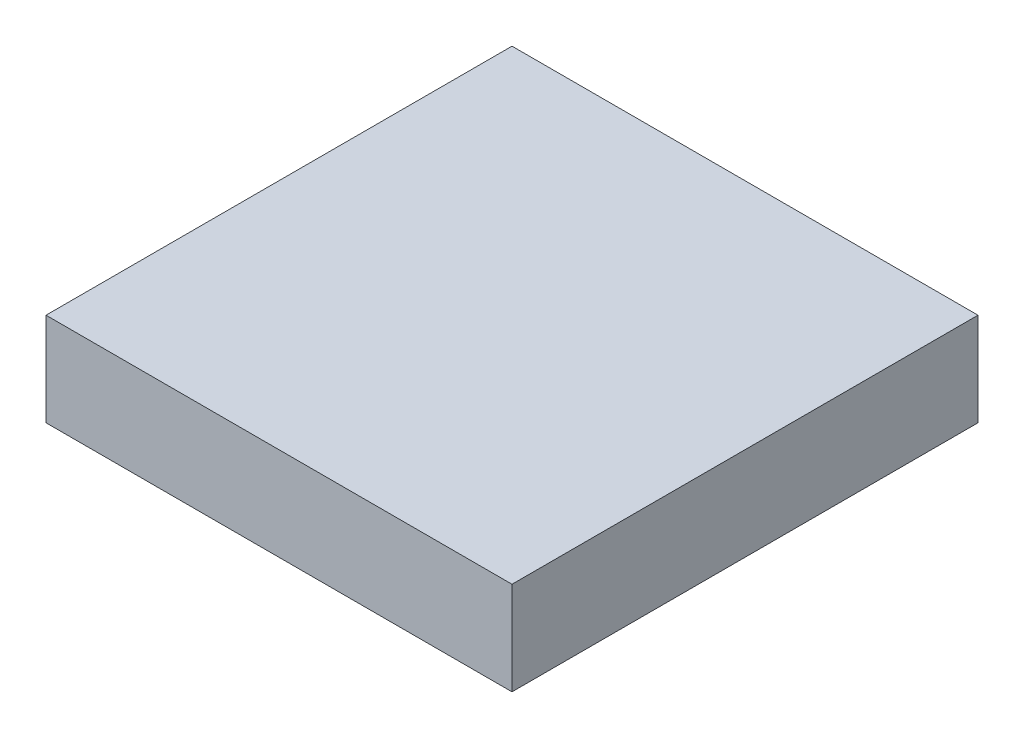
ISO-10303-21;
HEADER;
FILE_DESCRIPTION(('STEP AP214'),'2;1');
FILE_NAME('part.step','',(''),(''),'','','');
FILE_SCHEMA(('AUTOMOTIVE_DESIGN { 1 0 10303 214 1 1 1 1 }'));
ENDSEC;
DATA;
#1=APPLICATION_CONTEXT('core data for automotive mechanical design processes');
#2=APPLICATION_PROTOCOL_DEFINITION('international standard','automotive_design',2000,#1);
#3=PRODUCT_CONTEXT('',#1,'mechanical');
#4=PRODUCT('Part','Part','',(#3));
#5=PRODUCT_RELATED_PRODUCT_CATEGORY('part','',(#4));
#6=PRODUCT_DEFINITION_FORMATION('','',#4);
#7=PRODUCT_DEFINITION_CONTEXT('part definition',#1,'design');
#8=PRODUCT_DEFINITION('design','',#6,#7);
#9=PRODUCT_DEFINITION_SHAPE('','',#8);
#10=(LENGTH_UNIT() NAMED_UNIT(*) SI_UNIT(.MILLI.,.METRE.));
#11=(NAMED_UNIT(*) PLANE_ANGLE_UNIT() SI_UNIT($,.RADIAN.));
#12=(NAMED_UNIT(*) SI_UNIT($,.STERADIAN.) SOLID_ANGLE_UNIT());
#13=UNCERTAINTY_MEASURE_WITH_UNIT(LENGTH_MEASURE(1.E-05),#10,'distance_accuracy_value','');
#14=(GEOMETRIC_REPRESENTATION_CONTEXT(3) GLOBAL_UNCERTAINTY_ASSIGNED_CONTEXT((#13)) GLOBAL_UNIT_ASSIGNED_CONTEXT((#10,
#11,#12)) REPRESENTATION_CONTEXT('',''));
#15=CARTESIAN_POINT('',(0.,0.,0.));
#16=DIRECTION('',(0.,0.,1.));
#17=DIRECTION('',(1.,0.,0.));
#18=AXIS2_PLACEMENT_3D('',#15,#16,#17);
#19=CARTESIAN_POINT('',(7.5,3.,7.5));
#20=DIRECTION('',(-1.,0.,0.));
#21=DIRECTION('',(0.,0.,1.));
#22=AXIS2_PLACEMENT_3D('',#19,#20,#21);
#23=PLANE('',#22);
#24=DIRECTION('',(0.,0.,-1.));
#25=VECTOR('',#24,1.);
#26=CARTESIAN_POINT('',(7.5,0.,7.5));
#27=LINE('',#26,#25);
#28=CARTESIAN_POINT('',(7.5,0.,7.5));
#29=VERTEX_POINT('',#28);
#30=CARTESIAN_POINT('',(7.5,0.,-7.5));
#31=VERTEX_POINT('',#30);
#32=EDGE_CURVE('E145',#29,#31,#27,.T.);
#33=ORIENTED_EDGE('',*,*,#32,.T.);
#34=DIRECTION('',(0.,-1.,0.));
#35=VECTOR('',#34,1.);
#36=CARTESIAN_POINT('',(7.5,3.,-7.5));
#37=LINE('',#36,#35);
#38=CARTESIAN_POINT('',(7.5,3.,-7.5));
#39=VERTEX_POINT('',#38);
#40=EDGE_CURVE('E11',#39,#31,#37,.T.);
#41=ORIENTED_EDGE('',*,*,#40,.F.);
#42=DIRECTION('',(0.,0.,-1.));
#43=VECTOR('',#42,1.);
#44=CARTESIAN_POINT('',(7.5,3.,7.5));
#45=LINE('',#44,#43);
#46=CARTESIAN_POINT('',(7.5,3.,7.5));
#47=VERTEX_POINT('',#46);
#48=EDGE_CURVE('E149',#47,#39,#45,.T.);
#49=ORIENTED_EDGE('',*,*,#48,.F.);
#50=DIRECTION('',(0.,-1.,0.));
#51=VECTOR('',#50,1.);
#52=CARTESIAN_POINT('',(7.5,3.,7.5));
#53=LINE('',#52,#51);
#54=EDGE_CURVE('E155',#47,#29,#53,.T.);
#55=ORIENTED_EDGE('',*,*,#54,.T.);
#56=EDGE_LOOP('',(#33,#41,#49,#55));
#57=FACE_BOUND('',#56,.T.);
#58=ADVANCED_FACE('F33',(#57),#23,.F.);
#59=CARTESIAN_POINT('',(-7.5,3.,-7.5));
#60=DIRECTION('',(0.,0.,1.));
#61=DIRECTION('',(1.,0.,0.));
#62=AXIS2_PLACEMENT_3D('',#59,#60,#61);
#63=PLANE('',#62);
#64=DIRECTION('',(-1.,0.,0.));
#65=VECTOR('',#64,1.);
#66=CARTESIAN_POINT('',(-7.5,0.,-7.5));
#67=LINE('',#66,#65);
#68=CARTESIAN_POINT('',(-7.5,0.,-7.5));
#69=VERTEX_POINT('',#68);
#70=EDGE_CURVE('E158',#31,#69,#67,.T.);
#71=ORIENTED_EDGE('',*,*,#70,.T.);
#72=DIRECTION('',(0.,-1.,0.));
#73=VECTOR('',#72,1.);
#74=CARTESIAN_POINT('',(-7.5,3.,-7.5));
#75=LINE('',#74,#73);
#76=CARTESIAN_POINT('',(-7.5,3.,-7.5));
#77=VERTEX_POINT('',#76);
#78=EDGE_CURVE('E40',#77,#69,#75,.T.);
#79=ORIENTED_EDGE('',*,*,#78,.F.);
#80=DIRECTION('',(-1.,0.,0.));
#81=VECTOR('',#80,1.);
#82=CARTESIAN_POINT('',(-7.5,3.,-7.5));
#83=LINE('',#82,#81);
#84=EDGE_CURVE('E84',#39,#77,#83,.T.);
#85=ORIENTED_EDGE('',*,*,#84,.F.);
#86=ORIENTED_EDGE('',*,*,#40,.T.);
#87=EDGE_LOOP('',(#71,#79,#85,#86));
#88=FACE_BOUND('',#87,.T.);
#89=ADVANCED_FACE('F186',(#88),#63,.F.);
#90=CARTESIAN_POINT('',(-7.5,3.,7.5));
#91=DIRECTION('',(1.,0.,0.));
#92=DIRECTION('',(0.,0.,-1.));
#93=AXIS2_PLACEMENT_3D('',#90,#91,#92);
#94=PLANE('',#93);
#95=DIRECTION('',(0.,0.,1.));
#96=VECTOR('',#95,1.);
#97=CARTESIAN_POINT('',(-7.5,0.,7.5));
#98=LINE('',#97,#96);
#99=CARTESIAN_POINT('',(-7.5,0.,7.5));
#100=VERTEX_POINT('',#99);
#101=EDGE_CURVE('E160',#69,#100,#98,.T.);
#102=ORIENTED_EDGE('',*,*,#101,.T.);
#103=DIRECTION('',(0.,-1.,0.));
#104=VECTOR('',#103,1.);
#105=CARTESIAN_POINT('',(-7.5,3.,7.5));
#106=LINE('',#105,#104);
#107=CARTESIAN_POINT('',(-7.5,3.,7.5));
#108=VERTEX_POINT('',#107);
#109=EDGE_CURVE('E164',#108,#100,#106,.T.);
#110=ORIENTED_EDGE('',*,*,#109,.F.);
#111=DIRECTION('',(0.,0.,1.));
#112=VECTOR('',#111,1.);
#113=CARTESIAN_POINT('',(-7.5,3.,7.5));
#114=LINE('',#113,#112);
#115=EDGE_CURVE('E152',#77,#108,#114,.T.);
#116=ORIENTED_EDGE('',*,*,#115,.F.);
#117=ORIENTED_EDGE('',*,*,#78,.T.);
#118=EDGE_LOOP('',(#102,#110,#116,#117));
#119=FACE_BOUND('',#118,.T.);
#120=ADVANCED_FACE('F169',(#119),#94,.F.);
#121=CARTESIAN_POINT('',(-7.5,3.,7.5));
#122=DIRECTION('',(0.,0.,-1.));
#123=DIRECTION('',(-1.,0.,0.));
#124=AXIS2_PLACEMENT_3D('',#121,#122,#123);
#125=PLANE('',#124);
#126=DIRECTION('',(1.,0.,0.));
#127=VECTOR('',#126,1.);
#128=CARTESIAN_POINT('',(-7.5,0.,7.5));
#129=LINE('',#128,#127);
#130=EDGE_CURVE('E77',#100,#29,#129,.T.);
#131=ORIENTED_EDGE('',*,*,#130,.T.);
#132=ORIENTED_EDGE('',*,*,#54,.F.);
#133=DIRECTION('',(1.,0.,0.));
#134=VECTOR('',#133,1.);
#135=CARTESIAN_POINT('',(-7.5,3.,7.5));
#136=LINE('',#135,#134);
#137=EDGE_CURVE('E56',#108,#47,#136,.T.);
#138=ORIENTED_EDGE('',*,*,#137,.F.);
#139=ORIENTED_EDGE('',*,*,#109,.T.);
#140=EDGE_LOOP('',(#131,#132,#138,#139));
#141=FACE_BOUND('',#140,.T.);
#142=ADVANCED_FACE('F177',(#141),#125,.F.);
#143=CARTESIAN_POINT('',(0.,3.,0.));
#144=DIRECTION('',(0.,-1.,0.));
#145=DIRECTION('',(0.,0.,-1.));
#146=AXIS2_PLACEMENT_3D('',#143,#144,#145);
#147=PLANE('',#146);
#148=ORIENTED_EDGE('',*,*,#48,.T.);
#149=ORIENTED_EDGE('',*,*,#84,.T.);
#150=ORIENTED_EDGE('',*,*,#115,.T.);
#151=ORIENTED_EDGE('',*,*,#137,.T.);
#152=EDGE_LOOP('',(#148,#149,#150,#151));
#153=FACE_BOUND('',#152,.T.);
#154=ADVANCED_FACE('F179',(#153),#147,.F.);
#155=CARTESIAN_POINT('',(0.,0.,0.));
#156=DIRECTION('',(0.,-1.,0.));
#157=DIRECTION('',(0.,0.,-1.));
#158=AXIS2_PLACEMENT_3D('',#155,#156,#157);
#159=PLANE('',#158);
#160=CARTESIAN_POINT('',(-6.7,0.,-6.7));
#161=DIRECTION('',(0.,-1.,0.));
#162=DIRECTION('',(0.,0.,-1.));
#163=AXIS2_PLACEMENT_3D('',#160,#161,#162);
#164=CIRCLE('',#163,0.750000000000001);
#165=CARTESIAN_POINT('',(-6.7,0.,-7.45));
#166=VERTEX_POINT('',#165);
#167=EDGE_CURVE('E369',#166,#166,#164,.T.);
#168=ORIENTED_EDGE('',*,*,#167,.F.);
#169=EDGE_LOOP('',(#168));
#170=FACE_BOUND('',#169,.T.);
#171=CARTESIAN_POINT('',(6.7,0.,-6.7));
#172=DIRECTION('',(0.,-1.,0.));
#173=DIRECTION('',(0.,0.,-1.));
#174=AXIS2_PLACEMENT_3D('',#171,#172,#173);
#175=CIRCLE('',#174,0.750000000000001);
#176=CARTESIAN_POINT('',(6.7,0.,-7.45));
#177=VERTEX_POINT('',#176);
#178=EDGE_CURVE('E368',#177,#177,#175,.T.);
#179=ORIENTED_EDGE('',*,*,#178,.F.);
#180=EDGE_LOOP('',(#179));
#181=FACE_BOUND('',#180,.T.);
#182=CARTESIAN_POINT('',(6.7,0.,6.7));
#183=DIRECTION('',(0.,-1.,0.));
#184=DIRECTION('',(0.,0.,-1.));
#185=AXIS2_PLACEMENT_3D('',#182,#183,#184);
#186=CIRCLE('',#185,0.749999999999999);
#187=CARTESIAN_POINT('',(6.7,0.,5.95));
#188=VERTEX_POINT('',#187);
#189=EDGE_CURVE('E392',#188,#188,#186,.T.);
#190=ORIENTED_EDGE('',*,*,#189,.F.);
#191=EDGE_LOOP('',(#190));
#192=FACE_BOUND('',#191,.T.);
#193=CARTESIAN_POINT('',(-6.7,0.,6.7));
#194=DIRECTION('',(0.,-1.,0.));
#195=DIRECTION('',(0.,0.,-1.));
#196=AXIS2_PLACEMENT_3D('',#193,#194,#195);
#197=CIRCLE('',#196,0.750000000000001);
#198=CARTESIAN_POINT('',(-6.7,0.,5.95));
#199=VERTEX_POINT('',#198);
#200=EDGE_CURVE('E381',#199,#199,#197,.T.);
#201=ORIENTED_EDGE('',*,*,#200,.F.);
#202=EDGE_LOOP('',(#201));
#203=FACE_BOUND('',#202,.T.);
#204=DIRECTION('',(0.,0.,1.));
#205=VECTOR('',#204,1.);
#206=CARTESIAN_POINT('',(6.,0.,-6.));
#207=LINE('',#206,#205);
#208=CARTESIAN_POINT('',(6.,0.,-6.));
#209=VERTEX_POINT('',#208);
#210=CARTESIAN_POINT('',(6.,0.,6.));
#211=VERTEX_POINT('',#210);
#212=EDGE_CURVE('E47',#209,#211,#207,.T.);
#213=ORIENTED_EDGE('',*,*,#212,.F.);
#214=DIRECTION('',(1.,0.,0.));
#215=VECTOR('',#214,1.);
#216=CARTESIAN_POINT('',(-6.,0.,-6.));
#217=LINE('',#216,#215);
#218=CARTESIAN_POINT('',(-6.,0.,-6.));
#219=VERTEX_POINT('',#218);
#220=EDGE_CURVE('E126',#219,#209,#217,.T.);
#221=ORIENTED_EDGE('',*,*,#220,.F.);
#222=DIRECTION('',(0.,0.,-1.));
#223=VECTOR('',#222,1.);
#224=CARTESIAN_POINT('',(-6.,0.,-6.));
#225=LINE('',#224,#223);
#226=CARTESIAN_POINT('',(-6.,0.,6.));
#227=VERTEX_POINT('',#226);
#228=EDGE_CURVE('E129',#227,#219,#225,.T.);
#229=ORIENTED_EDGE('',*,*,#228,.F.);
#230=DIRECTION('',(-1.,0.,0.));
#231=VECTOR('',#230,1.);
#232=CARTESIAN_POINT('',(-6.,0.,6.));
#233=LINE('',#232,#231);
#234=EDGE_CURVE('E138',#211,#227,#233,.T.);
#235=ORIENTED_EDGE('',*,*,#234,.F.);
#236=EDGE_LOOP('',(#213,#221,#229,#235));
#237=FACE_BOUND('',#236,.T.);
#238=ORIENTED_EDGE('',*,*,#32,.F.);
#239=ORIENTED_EDGE('',*,*,#130,.F.);
#240=ORIENTED_EDGE('',*,*,#101,.F.);
#241=ORIENTED_EDGE('',*,*,#70,.F.);
#242=EDGE_LOOP('',(#238,#239,#240,#241));
#243=FACE_BOUND('',#242,.T.);
#244=ADVANCED_FACE('F173',(#170,#181,#192,#203,#237,#243),#159,.T.);
#245=CARTESIAN_POINT('',(6.,1.5,-6.));
#246=DIRECTION('',(1.,0.,0.));
#247=DIRECTION('',(0.,0.,-1.));
#248=AXIS2_PLACEMENT_3D('',#245,#246,#247);
#249=PLANE('',#248);
#250=ORIENTED_EDGE('',*,*,#212,.T.);
#251=DIRECTION('',(0.,-1.,0.));
#252=VECTOR('',#251,1.);
#253=CARTESIAN_POINT('',(6.,1.5,6.));
#254=LINE('',#253,#252);
#255=CARTESIAN_POINT('',(6.,1.5,6.));
#256=VERTEX_POINT('',#255);
#257=EDGE_CURVE('E104',#256,#211,#254,.T.);
#258=ORIENTED_EDGE('',*,*,#257,.F.);
#259=DIRECTION('',(0.,0.,1.));
#260=VECTOR('',#259,1.);
#261=CARTESIAN_POINT('',(6.,1.5,-6.));
#262=LINE('',#261,#260);
#263=CARTESIAN_POINT('',(6.,1.5,-6.));
#264=VERTEX_POINT('',#263);
#265=EDGE_CURVE('E108',#264,#256,#262,.T.);
#266=ORIENTED_EDGE('',*,*,#265,.F.);
#267=DIRECTION('',(0.,-1.,0.));
#268=VECTOR('',#267,1.);
#269=CARTESIAN_POINT('',(6.,1.5,-6.));
#270=LINE('',#269,#268);
#271=EDGE_CURVE('E143',#264,#209,#270,.T.);
#272=ORIENTED_EDGE('',*,*,#271,.T.);
#273=EDGE_LOOP('',(#250,#258,#266,#272));
#274=FACE_BOUND('',#273,.T.);
#275=ADVANCED_FACE('F106',(#274),#249,.F.);
#276=CARTESIAN_POINT('',(-6.,1.5,-6.));
#277=DIRECTION('',(0.,0.,-1.));
#278=DIRECTION('',(-1.,0.,0.));
#279=AXIS2_PLACEMENT_3D('',#276,#277,#278);
#280=PLANE('',#279);
#281=ORIENTED_EDGE('',*,*,#220,.T.);
#282=ORIENTED_EDGE('',*,*,#271,.F.);
#283=DIRECTION('',(1.,0.,0.));
#284=VECTOR('',#283,1.);
#285=CARTESIAN_POINT('',(-6.,1.5,-6.));
#286=LINE('',#285,#284);
#287=CARTESIAN_POINT('',(-6.,1.5,-6.));
#288=VERTEX_POINT('',#287);
#289=EDGE_CURVE('E114',#288,#264,#286,.T.);
#290=ORIENTED_EDGE('',*,*,#289,.F.);
#291=DIRECTION('',(0.,-1.,0.));
#292=VECTOR('',#291,1.);
#293=CARTESIAN_POINT('',(-6.,1.5,-6.));
#294=LINE('',#293,#292);
#295=EDGE_CURVE('E146',#288,#219,#294,.T.);
#296=ORIENTED_EDGE('',*,*,#295,.T.);
#297=EDGE_LOOP('',(#281,#282,#290,#296));
#298=FACE_BOUND('',#297,.T.);
#299=ADVANCED_FACE('F220',(#298),#280,.F.);
#300=CARTESIAN_POINT('',(-6.,1.5,-6.));
#301=DIRECTION('',(-1.,0.,0.));
#302=DIRECTION('',(0.,0.,1.));
#303=AXIS2_PLACEMENT_3D('',#300,#301,#302);
#304=PLANE('',#303);
#305=ORIENTED_EDGE('',*,*,#228,.T.);
#306=ORIENTED_EDGE('',*,*,#295,.F.);
#307=DIRECTION('',(0.,0.,-1.));
#308=VECTOR('',#307,1.);
#309=CARTESIAN_POINT('',(-6.,1.5,-6.));
#310=LINE('',#309,#308);
#311=CARTESIAN_POINT('',(-6.,1.5,6.));
#312=VERTEX_POINT('',#311);
#313=EDGE_CURVE('E122',#312,#288,#310,.T.);
#314=ORIENTED_EDGE('',*,*,#313,.F.);
#315=DIRECTION('',(0.,-1.,0.));
#316=VECTOR('',#315,1.);
#317=CARTESIAN_POINT('',(-6.,1.5,6.));
#318=LINE('',#317,#316);
#319=EDGE_CURVE('E113',#312,#227,#318,.T.);
#320=ORIENTED_EDGE('',*,*,#319,.T.);
#321=EDGE_LOOP('',(#305,#306,#314,#320));
#322=FACE_BOUND('',#321,.T.);
#323=ADVANCED_FACE('F230',(#322),#304,.F.);
#324=CARTESIAN_POINT('',(-6.,1.5,6.));
#325=DIRECTION('',(0.,0.,1.));
#326=DIRECTION('',(1.,0.,0.));
#327=AXIS2_PLACEMENT_3D('',#324,#325,#326);
#328=PLANE('',#327);
#329=ORIENTED_EDGE('',*,*,#234,.T.);
#330=ORIENTED_EDGE('',*,*,#319,.F.);
#331=DIRECTION('',(-1.,0.,0.));
#332=VECTOR('',#331,1.);
#333=CARTESIAN_POINT('',(-6.,1.5,6.));
#334=LINE('',#333,#332);
#335=EDGE_CURVE('E117',#256,#312,#334,.T.);
#336=ORIENTED_EDGE('',*,*,#335,.F.);
#337=ORIENTED_EDGE('',*,*,#257,.T.);
#338=EDGE_LOOP('',(#329,#330,#336,#337));
#339=FACE_BOUND('',#338,.T.);
#340=ADVANCED_FACE('F118',(#339),#328,.F.);
#341=CARTESIAN_POINT('',(0.,1.5,0.));
#342=DIRECTION('',(0.,1.,0.));
#343=DIRECTION('',(0.,0.,1.));
#344=AXIS2_PLACEMENT_3D('',#341,#342,#343);
#345=PLANE('',#344);
#346=CARTESIAN_POINT('',(0.,1.5,0.));
#347=DIRECTION('',(0.,-1.,0.));
#348=DIRECTION('',(0.,0.,-1.));
#349=AXIS2_PLACEMENT_3D('',#346,#347,#348);
#350=CIRCLE('',#349,2.5);
#351=CARTESIAN_POINT('',(0.,1.5,-2.5));
#352=VERTEX_POINT('',#351);
#353=EDGE_CURVE('E139',#352,#352,#350,.T.);
#354=ORIENTED_EDGE('',*,*,#353,.F.);
#355=EDGE_LOOP('',(#354));
#356=FACE_BOUND('',#355,.T.);
#357=ORIENTED_EDGE('',*,*,#265,.T.);
#358=ORIENTED_EDGE('',*,*,#335,.T.);
#359=ORIENTED_EDGE('',*,*,#313,.T.);
#360=ORIENTED_EDGE('',*,*,#289,.T.);
#361=EDGE_LOOP('',(#357,#358,#359,#360));
#362=FACE_BOUND('',#361,.T.);
#363=ADVANCED_FACE('F124',(#356,#362),#345,.F.);
#364=CARTESIAN_POINT('',(0.,1.5,0.));
#365=DIRECTION('',(0.,-1.,0.));
#366=DIRECTION('',(0.,0.,-1.));
#367=AXIS2_PLACEMENT_3D('',#364,#365,#366);
#368=CYLINDRICAL_SURFACE('',#367,2.5);
#369=ORIENTED_EDGE('',*,*,#353,.T.);
#370=EDGE_LOOP('',(#369));
#371=FACE_BOUND('',#370,.T.);
#372=CARTESIAN_POINT('',(0.,0.,0.));
#373=DIRECTION('',(0.,-1.,0.));
#374=DIRECTION('',(0.,0.,-1.));
#375=AXIS2_PLACEMENT_3D('',#372,#373,#374);
#376=CIRCLE('',#375,2.5);
#377=CARTESIAN_POINT('',(0.,0.,-2.5));
#378=VERTEX_POINT('',#377);
#379=EDGE_CURVE('E132',#378,#378,#376,.T.);
#380=ORIENTED_EDGE('',*,*,#379,.F.);
#381=EDGE_LOOP('',(#380));
#382=FACE_BOUND('',#381,.T.);
#383=ADVANCED_FACE('F257',(#371,#382),#368,.T.);
#384=ORIENTED_EDGE('',*,*,#379,.T.);
#385=EDGE_LOOP('',(#384));
#386=FACE_BOUND('',#385,.T.);
#387=ADVANCED_FACE('F267',(#386),#159,.T.);
#388=CARTESIAN_POINT('',(-6.7,2.,6.7));
#389=DIRECTION('',(0.,-1.,0.));
#390=DIRECTION('',(0.,0.,-1.));
#391=AXIS2_PLACEMENT_3D('',#388,#389,#390);
#392=CYLINDRICAL_SURFACE('',#391,0.750000000000001);
#393=CARTESIAN_POINT('',(-6.7,2.,6.7));
#394=DIRECTION('',(0.,-1.,0.));
#395=DIRECTION('',(0.,0.,-1.));
#396=AXIS2_PLACEMENT_3D('',#393,#394,#395);
#397=CIRCLE('',#396,0.750000000000001);
#398=CARTESIAN_POINT('',(-6.7,2.,5.95));
#399=VERTEX_POINT('',#398);
#400=EDGE_CURVE('E378',#399,#399,#397,.T.);
#401=ORIENTED_EDGE('',*,*,#400,.F.);
#402=EDGE_LOOP('',(#401));
#403=FACE_BOUND('',#402,.T.);
#404=ORIENTED_EDGE('',*,*,#200,.T.);
#405=EDGE_LOOP('',(#404));
#406=FACE_BOUND('',#405,.T.);
#407=ADVANCED_FACE('F277',(#403,#406),#392,.F.);
#408=CARTESIAN_POINT('',(-6.7,2.,6.7));
#409=DIRECTION('',(0.,-1.,0.));
#410=DIRECTION('',(0.,0.,-1.));
#411=AXIS2_PLACEMENT_3D('',#408,#409,#410);
#412=PLANE('',#411);
#413=ORIENTED_EDGE('',*,*,#400,.T.);
#414=EDGE_LOOP('',(#413));
#415=FACE_BOUND('',#414,.T.);
#416=ADVANCED_FACE('F291',(#415),#412,.T.);
#417=CARTESIAN_POINT('',(6.7,2.,6.7));
#418=DIRECTION('',(0.,-1.,0.));
#419=DIRECTION('',(0.,0.,-1.));
#420=AXIS2_PLACEMENT_3D('',#417,#418,#419);
#421=CYLINDRICAL_SURFACE('',#420,0.749999999999999);
#422=CARTESIAN_POINT('',(6.7,2.,6.7));
#423=DIRECTION('',(0.,-1.,0.));
#424=DIRECTION('',(0.,0.,-1.));
#425=AXIS2_PLACEMENT_3D('',#422,#423,#424);
#426=CIRCLE('',#425,0.749999999999999);
#427=CARTESIAN_POINT('',(6.7,2.,5.95));
#428=VERTEX_POINT('',#427);
#429=EDGE_CURVE('E383',#428,#428,#426,.T.);
#430=ORIENTED_EDGE('',*,*,#429,.F.);
#431=EDGE_LOOP('',(#430));
#432=FACE_BOUND('',#431,.T.);
#433=ORIENTED_EDGE('',*,*,#189,.T.);
#434=EDGE_LOOP('',(#433));
#435=FACE_BOUND('',#434,.T.);
#436=ADVANCED_FACE('F301',(#432,#435),#421,.F.);
#437=CARTESIAN_POINT('',(6.7,2.,6.7));
#438=DIRECTION('',(0.,-1.,0.));
#439=DIRECTION('',(0.,0.,-1.));
#440=AXIS2_PLACEMENT_3D('',#437,#438,#439);
#441=PLANE('',#440);
#442=ORIENTED_EDGE('',*,*,#429,.T.);
#443=EDGE_LOOP('',(#442));
#444=FACE_BOUND('',#443,.T.);
#445=ADVANCED_FACE('F311',(#444),#441,.T.);
#446=CARTESIAN_POINT('',(6.7,2.,-6.7));
#447=DIRECTION('',(0.,-1.,0.));
#448=DIRECTION('',(0.,0.,-1.));
#449=AXIS2_PLACEMENT_3D('',#446,#447,#448);
#450=CYLINDRICAL_SURFACE('',#449,0.750000000000001);
#451=CARTESIAN_POINT('',(6.7,2.,-6.7));
#452=DIRECTION('',(0.,-1.,0.));
#453=DIRECTION('',(0.,0.,-1.));
#454=AXIS2_PLACEMENT_3D('',#451,#452,#453);
#455=CIRCLE('',#454,0.750000000000001);
#456=CARTESIAN_POINT('',(6.7,2.,-7.45));
#457=VERTEX_POINT('',#456);
#458=EDGE_CURVE('E372',#457,#457,#455,.T.);
#459=ORIENTED_EDGE('',*,*,#458,.F.);
#460=EDGE_LOOP('',(#459));
#461=FACE_BOUND('',#460,.T.);
#462=ORIENTED_EDGE('',*,*,#178,.T.);
#463=EDGE_LOOP('',(#462));
#464=FACE_BOUND('',#463,.T.);
#465=ADVANCED_FACE('F321',(#461,#464),#450,.F.);
#466=CARTESIAN_POINT('',(6.7,2.,-6.7));
#467=DIRECTION('',(0.,-1.,0.));
#468=DIRECTION('',(0.,0.,-1.));
#469=AXIS2_PLACEMENT_3D('',#466,#467,#468);
#470=PLANE('',#469);
#471=ORIENTED_EDGE('',*,*,#458,.T.);
#472=EDGE_LOOP('',(#471));
#473=FACE_BOUND('',#472,.T.);
#474=ADVANCED_FACE('F331',(#473),#470,.T.);
#475=CARTESIAN_POINT('',(-6.7,2.,-6.7));
#476=DIRECTION('',(0.,-1.,0.));
#477=DIRECTION('',(0.,0.,-1.));
#478=AXIS2_PLACEMENT_3D('',#475,#476,#477);
#479=CYLINDRICAL_SURFACE('',#478,0.750000000000001);
#480=CARTESIAN_POINT('',(-6.7,2.,-6.7));
#481=DIRECTION('',(0.,-1.,0.));
#482=DIRECTION('',(0.,0.,-1.));
#483=AXIS2_PLACEMENT_3D('',#480,#481,#482);
#484=CIRCLE('',#483,0.750000000000001);
#485=CARTESIAN_POINT('',(-6.7,2.,-7.45));
#486=VERTEX_POINT('',#485);
#487=EDGE_CURVE('E367',#486,#486,#484,.T.);
#488=ORIENTED_EDGE('',*,*,#487,.F.);
#489=EDGE_LOOP('',(#488));
#490=FACE_BOUND('',#489,.T.);
#491=ORIENTED_EDGE('',*,*,#167,.T.);
#492=EDGE_LOOP('',(#491));
#493=FACE_BOUND('',#492,.T.);
#494=ADVANCED_FACE('F341',(#490,#493),#479,.F.);
#495=CARTESIAN_POINT('',(-6.7,2.,-6.7));
#496=DIRECTION('',(0.,-1.,0.));
#497=DIRECTION('',(0.,0.,-1.));
#498=AXIS2_PLACEMENT_3D('',#495,#496,#497);
#499=PLANE('',#498);
#500=ORIENTED_EDGE('',*,*,#487,.T.);
#501=EDGE_LOOP('',(#500));
#502=FACE_BOUND('',#501,.T.);
#503=ADVANCED_FACE('F351',(#502),#499,.T.);
#504=CLOSED_SHELL('',(#58,#89,#120,#142,#154,#244,#275,#299,#323,#340,#363,#383,#387,#407,#416,
#436,#445,#465,#474,#494,#503));
#505=MANIFOLD_SOLID_BREP('B2',#504);
#506=ADVANCED_BREP_SHAPE_REPRESENTATION('',(#18,#505),#14);
#507=SHAPE_DEFINITION_REPRESENTATION(#9,#506);
ENDSEC;
END-ISO-10303-21;
